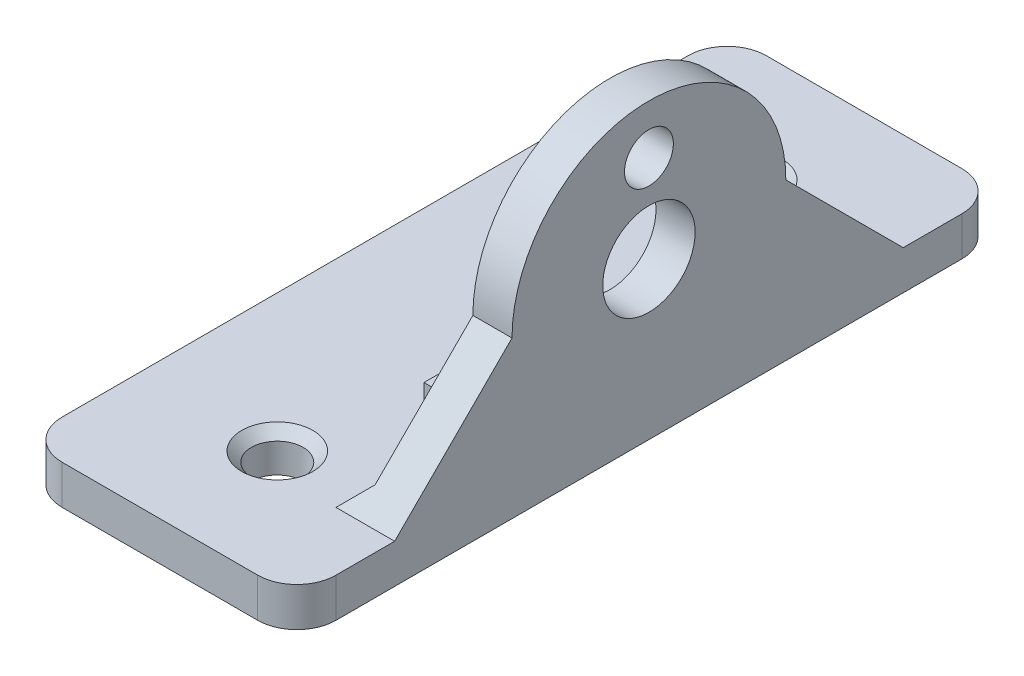
ISO-10303-21;
HEADER;
FILE_DESCRIPTION(('STEP AP214'),'2;1');
FILE_NAME('part.step','',(''),(''),'','','');
FILE_SCHEMA(('AUTOMOTIVE_DESIGN { 1 0 10303 214 1 1 1 1 }'));
ENDSEC;
DATA;
#1=APPLICATION_CONTEXT('core data for automotive mechanical design processes');
#2=APPLICATION_PROTOCOL_DEFINITION('international standard','automotive_design',2000,#1);
#3=PRODUCT_CONTEXT('',#1,'mechanical');
#4=PRODUCT('Part','Part','',(#3));
#5=PRODUCT_RELATED_PRODUCT_CATEGORY('part','',(#4));
#6=PRODUCT_DEFINITION_FORMATION('','',#4);
#7=PRODUCT_DEFINITION_CONTEXT('part definition',#1,'design');
#8=PRODUCT_DEFINITION('design','',#6,#7);
#9=PRODUCT_DEFINITION_SHAPE('','',#8);
#10=(LENGTH_UNIT() NAMED_UNIT(*) SI_UNIT(.MILLI.,.METRE.));
#11=(NAMED_UNIT(*) PLANE_ANGLE_UNIT() SI_UNIT($,.RADIAN.));
#12=(NAMED_UNIT(*) SI_UNIT($,.STERADIAN.) SOLID_ANGLE_UNIT());
#13=UNCERTAINTY_MEASURE_WITH_UNIT(LENGTH_MEASURE(1.E-05),#10,'distance_accuracy_value','');
#14=(GEOMETRIC_REPRESENTATION_CONTEXT(3) GLOBAL_UNCERTAINTY_ASSIGNED_CONTEXT((#13)) GLOBAL_UNIT_ASSIGNED_CONTEXT((#10,
#11,#12)) REPRESENTATION_CONTEXT('',''));
#15=CARTESIAN_POINT('',(0.,0.,0.));
#16=DIRECTION('',(0.,0.,1.));
#17=DIRECTION('',(1.,0.,0.));
#18=AXIS2_PLACEMENT_3D('',#15,#16,#17);
#19=CARTESIAN_POINT('',(-3.175,12.7,0.));
#20=DIRECTION('',(1.,0.,0.));
#21=DIRECTION('',(0.,0.,-1.));
#22=AXIS2_PLACEMENT_3D('',#19,#20,#21);
#23=PLANE('',#22);
#24=CARTESIAN_POINT('',(-3.175,19.812,0.));
#25=DIRECTION('',(1.,0.,0.));
#26=DIRECTION('',(0.,0.,-1.));
#27=AXIS2_PLACEMENT_3D('',#24,#25,#26);
#28=CIRCLE('',#27,1.984375);
#29=CARTESIAN_POINT('',(-3.175,19.812,-1.984375));
#30=VERTEX_POINT('',#29);
#31=EDGE_CURVE('E217',#30,#30,#28,.T.);
#32=ORIENTED_EDGE('',*,*,#31,.T.);
#33=EDGE_LOOP('',(#32));
#34=FACE_BOUND('',#33,.T.);
#35=CARTESIAN_POINT('',(-3.175,12.7,0.));
#36=DIRECTION('',(1.,0.,0.));
#37=DIRECTION('',(0.,0.,-1.));
#38=AXIS2_PLACEMENT_3D('',#35,#36,#37);
#39=CIRCLE('',#38,3.75);
#40=CARTESIAN_POINT('',(-3.175,12.7,-3.75));
#41=VERTEX_POINT('',#40);
#42=EDGE_CURVE('E223',#41,#41,#39,.T.);
#43=ORIENTED_EDGE('',*,*,#42,.T.);
#44=EDGE_LOOP('',(#43));
#45=FACE_BOUND('',#44,.T.);
#46=DIRECTION('',(0.,0.707106781186549,0.707106781186546));
#47=VECTOR('',#46,1.);
#48=CARTESIAN_POINT('',(-3.175,3.17500000000001,-20.6375));
#49=LINE('',#48,#47);
#50=CARTESIAN_POINT('',(-3.175,4.76250000000002,-19.05));
#51=VERTEX_POINT('',#50);
#52=CARTESIAN_POINT('',(-3.175,12.7,-11.1125));
#53=VERTEX_POINT('',#52);
#54=EDGE_CURVE('E229',#51,#53,#49,.T.);
#55=ORIENTED_EDGE('',*,*,#54,.F.);
#56=DIRECTION('',(0.,0.,1.));
#57=VECTOR('',#56,1.);
#58=CARTESIAN_POINT('',(-3.175,4.76250000000001,0.));
#59=LINE('',#58,#57);
#60=CARTESIAN_POINT('',(-3.175,4.76250000000001,7.9375));
#61=VERTEX_POINT('',#60);
#62=EDGE_CURVE('E292',#51,#61,#59,.T.);
#63=ORIENTED_EDGE('',*,*,#62,.T.);
#64=DIRECTION('',(0.,-1.,0.));
#65=VECTOR('',#64,1.);
#66=CARTESIAN_POINT('',(-3.175,5.20700000000001,7.9375));
#67=LINE('',#66,#65);
#68=CARTESIAN_POINT('',(-3.175,5.20700000000001,7.9375));
#69=VERTEX_POINT('',#68);
#70=EDGE_CURVE('E198',#69,#61,#67,.T.);
#71=ORIENTED_EDGE('',*,*,#70,.F.);
#72=DIRECTION('',(0.,0.,-1.));
#73=VECTOR('',#72,1.);
#74=CARTESIAN_POINT('',(-3.175,5.20700000000001,7.9375));
#75=LINE('',#74,#73);
#76=CARTESIAN_POINT('',(-3.175,5.20700000000001,10.31875));
#77=VERTEX_POINT('',#76);
#78=EDGE_CURVE('E204',#77,#69,#75,.T.);
#79=ORIENTED_EDGE('',*,*,#78,.F.);
#80=DIRECTION('',(0.,1.,0.));
#81=VECTOR('',#80,1.);
#82=CARTESIAN_POINT('',(-3.175,5.20700000000001,10.31875));
#83=LINE('',#82,#81);
#84=CARTESIAN_POINT('',(-3.175,4.76250000000001,10.31875));
#85=VERTEX_POINT('',#84);
#86=EDGE_CURVE('E201',#85,#77,#83,.T.);
#87=ORIENTED_EDGE('',*,*,#86,.F.);
#88=DIRECTION('',(0.,0.,1.));
#89=VECTOR('',#88,1.);
#90=CARTESIAN_POINT('',(-3.175,4.76250000000002,0.));
#91=LINE('',#90,#89);
#92=CARTESIAN_POINT('',(-3.175,4.76250000000001,19.0499999999999));
#93=VERTEX_POINT('',#92);
#94=EDGE_CURVE('E290',#85,#93,#91,.T.);
#95=ORIENTED_EDGE('',*,*,#94,.T.);
#96=DIRECTION('',(0.,-0.707106781186549,0.707106781186546));
#97=VECTOR('',#96,1.);
#98=CARTESIAN_POINT('',(-3.175,3.175,20.6374999999999));
#99=LINE('',#98,#97);
#100=CARTESIAN_POINT('',(-3.175,12.7,11.1125));
#101=VERTEX_POINT('',#100);
#102=EDGE_CURVE('E235',#101,#93,#99,.T.);
#103=ORIENTED_EDGE('',*,*,#102,.F.);
#104=CARTESIAN_POINT('',(-3.175,12.7,0.));
#105=DIRECTION('',(1.,0.,0.));
#106=DIRECTION('',(0.,0.,-1.));
#107=AXIS2_PLACEMENT_3D('',#104,#105,#106);
#108=CIRCLE('',#107,11.1125);
#109=EDGE_CURVE('E231',#53,#101,#108,.T.);
#110=ORIENTED_EDGE('',*,*,#109,.F.);
#111=EDGE_LOOP('',(#55,#63,#71,#79,#87,#95,#103,#110));
#112=FACE_BOUND('',#111,.T.);
#113=ADVANCED_FACE('F40',(#34,#45,#112),#23,.F.);
#114=CARTESIAN_POINT('',(-3.175,3.175,20.6374999999999));
#115=DIRECTION('',(0.,1.,0.));
#116=DIRECTION('',(0.,0.,1.));
#117=AXIS2_PLACEMENT_3D('',#114,#115,#116);
#118=PLANE('',#117);
#119=CARTESIAN_POINT('',(-11.1125,3.175,19.05));
#120=DIRECTION('',(0.,1.,0.));
#121=DIRECTION('',(0.,0.,1.));
#122=AXIS2_PLACEMENT_3D('',#119,#120,#121);
#123=CIRCLE('',#122,2.88925000000004);
#124=CARTESIAN_POINT('',(-11.1125,3.175,21.93925));
#125=VERTEX_POINT('',#124);
#126=EDGE_CURVE('E280',#125,#125,#123,.F.);
#127=ORIENTED_EDGE('',*,*,#126,.T.);
#128=EDGE_LOOP('',(#127));
#129=FACE_BOUND('',#128,.T.);
#130=CARTESIAN_POINT('',(-11.1125,3.17500000000001,-19.05));
#131=DIRECTION('',(0.,1.,0.));
#132=DIRECTION('',(0.,0.,1.));
#133=AXIS2_PLACEMENT_3D('',#130,#131,#132);
#134=CIRCLE('',#133,2.88925000000002);
#135=CARTESIAN_POINT('',(-11.1125,3.175,-16.16075));
#136=VERTEX_POINT('',#135);
#137=EDGE_CURVE('E277',#136,#136,#134,.F.);
#138=ORIENTED_EDGE('',*,*,#137,.T.);
#139=EDGE_LOOP('',(#138));
#140=FACE_BOUND('',#139,.T.);
#141=DIRECTION('',(0.,0.,1.));
#142=VECTOR('',#141,1.);
#143=CARTESIAN_POINT('',(0.,3.17500000000001,-28.575));
#144=LINE('',#143,#142);
#145=CARTESIAN_POINT('',(0.,3.17500000000001,-25.4));
#146=VERTEX_POINT('',#145);
#147=CARTESIAN_POINT('',(0.,3.17500000000001,-20.6375));
#148=VERTEX_POINT('',#147);
#149=EDGE_CURVE('E241',#146,#148,#144,.T.);
#150=ORIENTED_EDGE('',*,*,#149,.F.);
#151=CARTESIAN_POINT('',(-3.175,3.17500000000001,-25.4));
#152=DIRECTION('',(0.,1.,0.));
#153=DIRECTION('',(0.,0.,1.));
#154=AXIS2_PLACEMENT_3D('',#151,#152,#153);
#155=CIRCLE('',#154,3.175);
#156=CARTESIAN_POINT('',(-3.175,3.17500000000001,-28.575));
#157=VERTEX_POINT('',#156);
#158=EDGE_CURVE('E315',#146,#157,#155,.T.);
#159=ORIENTED_EDGE('',*,*,#158,.T.);
#160=DIRECTION('',(1.,0.,0.));
#161=VECTOR('',#160,1.);
#162=CARTESIAN_POINT('',(-3.175,3.17500000000001,-28.575));
#163=LINE('',#162,#161);
#164=CARTESIAN_POINT('',(-19.05,3.17500000000001,-28.575));
#165=VERTEX_POINT('',#164);
#166=EDGE_CURVE('E267',#165,#157,#163,.T.);
#167=ORIENTED_EDGE('',*,*,#166,.F.);
#168=CARTESIAN_POINT('',(-19.05,3.17500000000001,-25.4));
#169=DIRECTION('',(0.,1.,0.));
#170=DIRECTION('',(0.,0.,1.));
#171=AXIS2_PLACEMENT_3D('',#168,#169,#170);
#172=CIRCLE('',#171,3.175);
#173=CARTESIAN_POINT('',(-22.225,3.17500000000001,-25.4));
#174=VERTEX_POINT('',#173);
#175=EDGE_CURVE('E313',#165,#174,#172,.T.);
#176=ORIENTED_EDGE('',*,*,#175,.T.);
#177=DIRECTION('',(0.,0.,-1.));
#178=VECTOR('',#177,1.);
#179=CARTESIAN_POINT('',(-22.225,3.17500000000001,-28.575));
#180=LINE('',#179,#178);
#181=CARTESIAN_POINT('',(-22.225,3.17500000000001,25.4));
#182=VERTEX_POINT('',#181);
#183=EDGE_CURVE('E213',#182,#174,#180,.T.);
#184=ORIENTED_EDGE('',*,*,#183,.F.);
#185=CARTESIAN_POINT('',(-19.05,3.175,25.4));
#186=DIRECTION('',(0.,1.,0.));
#187=DIRECTION('',(0.,0.,1.));
#188=AXIS2_PLACEMENT_3D('',#185,#186,#187);
#189=CIRCLE('',#188,3.175);
#190=CARTESIAN_POINT('',(-19.05,3.175,28.575));
#191=VERTEX_POINT('',#190);
#192=EDGE_CURVE('E311',#182,#191,#189,.T.);
#193=ORIENTED_EDGE('',*,*,#192,.T.);
#194=DIRECTION('',(1.,0.,0.));
#195=VECTOR('',#194,1.);
#196=CARTESIAN_POINT('',(-3.175,3.175,28.575));
#197=LINE('',#196,#195);
#198=CARTESIAN_POINT('',(-3.175,3.175,28.575));
#199=VERTEX_POINT('',#198);
#200=EDGE_CURVE('E254',#191,#199,#197,.T.);
#201=ORIENTED_EDGE('',*,*,#200,.T.);
#202=CARTESIAN_POINT('',(-3.175,3.175,25.4));
#203=DIRECTION('',(0.,1.,0.));
#204=DIRECTION('',(0.,0.,1.));
#205=AXIS2_PLACEMENT_3D('',#202,#203,#204);
#206=CIRCLE('',#205,3.175);
#207=CARTESIAN_POINT('',(0.,3.175,25.4));
#208=VERTEX_POINT('',#207);
#209=EDGE_CURVE('E309',#199,#208,#206,.T.);
#210=ORIENTED_EDGE('',*,*,#209,.T.);
#211=DIRECTION('',(0.,0.,1.));
#212=VECTOR('',#211,1.);
#213=CARTESIAN_POINT('',(0.,3.175,20.6374999999999));
#214=LINE('',#213,#212);
#215=CARTESIAN_POINT('',(0.,3.175,20.6374999999999));
#216=VERTEX_POINT('',#215);
#217=EDGE_CURVE('E232',#216,#208,#214,.T.);
#218=ORIENTED_EDGE('',*,*,#217,.F.);
#219=DIRECTION('',(1.,0.,0.));
#220=VECTOR('',#219,1.);
#221=CARTESIAN_POINT('',(-3.175,3.175,20.6374999999999));
#222=LINE('',#221,#220);
#223=CARTESIAN_POINT('',(-4.76250000000003,3.175,20.6374999999999));
#224=VERTEX_POINT('',#223);
#225=EDGE_CURVE('E258',#224,#216,#222,.T.);
#226=ORIENTED_EDGE('',*,*,#225,.F.);
#227=DIRECTION('',(0.,0.,-1.));
#228=VECTOR('',#227,1.);
#229=CARTESIAN_POINT('',(-4.76250000000003,3.175,20.6374999999999));
#230=LINE('',#229,#228);
#231=CARTESIAN_POINT('',(-4.76250000000003,3.17500000000001,10.31875));
#232=VERTEX_POINT('',#231);
#233=EDGE_CURVE('E175',#224,#232,#230,.T.);
#234=ORIENTED_EDGE('',*,*,#233,.T.);
#235=DIRECTION('',(1.,0.,0.));
#236=VECTOR('',#235,1.);
#237=CARTESIAN_POINT('',(-7.9375,3.17500000000001,10.31875));
#238=LINE('',#237,#236);
#239=CARTESIAN_POINT('',(-7.9375,3.17500000000001,10.31875));
#240=VERTEX_POINT('',#239);
#241=EDGE_CURVE('E167',#240,#232,#238,.T.);
#242=ORIENTED_EDGE('',*,*,#241,.F.);
#243=DIRECTION('',(0.,0.,1.));
#244=VECTOR('',#243,1.);
#245=CARTESIAN_POINT('',(-7.9375,3.17500000000001,7.9375));
#246=LINE('',#245,#244);
#247=CARTESIAN_POINT('',(-7.9375,3.175,7.9375));
#248=VERTEX_POINT('',#247);
#249=EDGE_CURVE('E172',#248,#240,#246,.T.);
#250=ORIENTED_EDGE('',*,*,#249,.F.);
#251=DIRECTION('',(1.,0.,0.));
#252=VECTOR('',#251,1.);
#253=CARTESIAN_POINT('',(-7.9375,3.17500000000001,7.9375));
#254=LINE('',#253,#252);
#255=CARTESIAN_POINT('',(-4.76250000000003,3.17500000000001,7.9375));
#256=VERTEX_POINT('',#255);
#257=EDGE_CURVE('E178',#248,#256,#254,.T.);
#258=ORIENTED_EDGE('',*,*,#257,.T.);
#259=DIRECTION('',(0.,0.,-1.));
#260=VECTOR('',#259,1.);
#261=CARTESIAN_POINT('',(-4.76250000000003,3.175,20.6374999999999));
#262=LINE('',#261,#260);
#263=CARTESIAN_POINT('',(-4.76250000000003,3.17500000000001,-20.6375));
#264=VERTEX_POINT('',#263);
#265=EDGE_CURVE('E287',#256,#264,#262,.T.);
#266=ORIENTED_EDGE('',*,*,#265,.T.);
#267=DIRECTION('',(1.,0.,0.));
#268=VECTOR('',#267,1.);
#269=CARTESIAN_POINT('',(-3.175,3.17500000000001,-20.6375));
#270=LINE('',#269,#268);
#271=EDGE_CURVE('E264',#264,#148,#270,.T.);
#272=ORIENTED_EDGE('',*,*,#271,.T.);
#273=EDGE_LOOP('',(#150,#159,#167,#176,#184,#193,#201,#210,#218,#226,#234,#242,#250,#258,#266,#272));
#274=FACE_BOUND('',#273,.T.);
#275=ADVANCED_FACE('F170',(#129,#140,#274),#118,.T.);
#276=CARTESIAN_POINT('',(-3.175,3.175,28.575));
#277=DIRECTION('',(0.,0.,1.));
#278=DIRECTION('',(1.,0.,0.));
#279=AXIS2_PLACEMENT_3D('',#276,#277,#278);
#280=PLANE('',#279);
#281=ORIENTED_EDGE('',*,*,#200,.F.);
#282=DIRECTION('',(0.,1.,0.));
#283=VECTOR('',#282,1.);
#284=CARTESIAN_POINT('',(-19.05,3.175,28.575));
#285=LINE('',#284,#283);
#286=CARTESIAN_POINT('',(-19.05,0.,28.575));
#287=VERTEX_POINT('',#286);
#288=EDGE_CURVE('E11',#191,#287,#285,.F.);
#289=ORIENTED_EDGE('',*,*,#288,.T.);
#290=DIRECTION('',(1.,0.,0.));
#291=VECTOR('',#290,1.);
#292=CARTESIAN_POINT('',(-3.175,0.,28.575));
#293=LINE('',#292,#291);
#294=CARTESIAN_POINT('',(-3.175,0.,28.575));
#295=VERTEX_POINT('',#294);
#296=EDGE_CURVE('E238',#287,#295,#293,.T.);
#297=ORIENTED_EDGE('',*,*,#296,.T.);
#298=DIRECTION('',(0.,-1.,0.));
#299=VECTOR('',#298,1.);
#300=CARTESIAN_POINT('',(-3.175,3.175,28.575));
#301=LINE('',#300,#299);
#302=EDGE_CURVE('E48',#295,#199,#301,.F.);
#303=ORIENTED_EDGE('',*,*,#302,.T.);
#304=EDGE_LOOP('',(#281,#289,#297,#303));
#305=FACE_BOUND('',#304,.T.);
#306=ADVANCED_FACE('F334',(#305),#280,.T.);
#307=CARTESIAN_POINT('',(-3.175,3.175,20.6374999999999));
#308=DIRECTION('',(0.,0.707106781186546,0.707106781186549));
#309=DIRECTION('',(0.,-0.707106781186549,0.707106781186546));
#310=AXIS2_PLACEMENT_3D('',#307,#308,#309);
#311=PLANE('',#310);
#312=DIRECTION('',(0.,-0.707106781186549,0.707106781186546));
#313=VECTOR('',#312,1.);
#314=CARTESIAN_POINT('',(0.,3.175,20.6374999999999));
#315=LINE('',#314,#313);
#316=CARTESIAN_POINT('',(0.,12.7,11.1125));
#317=VERTEX_POINT('',#316);
#318=EDGE_CURVE('E249',#317,#216,#315,.T.);
#319=ORIENTED_EDGE('',*,*,#318,.F.);
#320=DIRECTION('',(1.,0.,0.));
#321=VECTOR('',#320,1.);
#322=CARTESIAN_POINT('',(-3.175,12.7,11.1125));
#323=LINE('',#322,#321);
#324=EDGE_CURVE('E260',#101,#317,#323,.T.);
#325=ORIENTED_EDGE('',*,*,#324,.F.);
#326=ORIENTED_EDGE('',*,*,#102,.T.);
#327=DIRECTION('',(-0.577350269189632,-0.577350269189624,0.577350269189622));
#328=VECTOR('',#327,1.);
#329=CARTESIAN_POINT('',(-4.76250000000003,3.175,20.6374999999999));
#330=LINE('',#329,#328);
#331=EDGE_CURVE('E300',#93,#224,#330,.T.);
#332=ORIENTED_EDGE('',*,*,#331,.T.);
#333=ORIENTED_EDGE('',*,*,#225,.T.);
#334=EDGE_LOOP('',(#319,#325,#326,#332,#333));
#335=FACE_BOUND('',#334,.T.);
#336=ADVANCED_FACE('F365',(#335),#311,.T.);
#337=CARTESIAN_POINT('',(-3.175,12.7,0.));
#338=DIRECTION('',(1.,0.,0.));
#339=DIRECTION('',(0.,0.,-1.));
#340=AXIS2_PLACEMENT_3D('',#337,#338,#339);
#341=CYLINDRICAL_SURFACE('',#340,11.1125);
#342=CARTESIAN_POINT('',(0.,12.7,0.));
#343=DIRECTION('',(1.,0.,0.));
#344=DIRECTION('',(0.,0.,-1.));
#345=AXIS2_PLACEMENT_3D('',#342,#343,#344);
#346=CIRCLE('',#345,11.1125);
#347=CARTESIAN_POINT('',(0.,12.7,-11.1125));
#348=VERTEX_POINT('',#347);
#349=EDGE_CURVE('E246',#348,#317,#346,.T.);
#350=ORIENTED_EDGE('',*,*,#349,.F.);
#351=DIRECTION('',(1.,0.,0.));
#352=VECTOR('',#351,1.);
#353=CARTESIAN_POINT('',(-3.175,12.7,-11.1125));
#354=LINE('',#353,#352);
#355=EDGE_CURVE('E262',#53,#348,#354,.T.);
#356=ORIENTED_EDGE('',*,*,#355,.F.);
#357=ORIENTED_EDGE('',*,*,#109,.T.);
#358=ORIENTED_EDGE('',*,*,#324,.T.);
#359=EDGE_LOOP('',(#350,#356,#357,#358));
#360=FACE_BOUND('',#359,.T.);
#361=ADVANCED_FACE('F361',(#360),#341,.T.);
#362=CARTESIAN_POINT('',(-3.175,3.17500000000001,-20.6375));
#363=DIRECTION('',(0.,0.707106781186546,-0.707106781186549));
#364=DIRECTION('',(0.,0.707106781186549,0.707106781186546));
#365=AXIS2_PLACEMENT_3D('',#362,#363,#364);
#366=PLANE('',#365);
#367=DIRECTION('',(0.,0.707106781186549,0.707106781186546));
#368=VECTOR('',#367,1.);
#369=CARTESIAN_POINT('',(0.,3.17500000000001,-20.6375));
#370=LINE('',#369,#368);
#371=EDGE_CURVE('E243',#148,#348,#370,.T.);
#372=ORIENTED_EDGE('',*,*,#371,.F.);
#373=ORIENTED_EDGE('',*,*,#271,.F.);
#374=DIRECTION('',(0.577350269189632,0.577350269189624,0.577350269189622));
#375=VECTOR('',#374,1.);
#376=CARTESIAN_POINT('',(8.99583333333331,16.9333333333332,-6.87916666666685));
#377=LINE('',#376,#375);
#378=EDGE_CURVE('E298',#264,#51,#377,.T.);
#379=ORIENTED_EDGE('',*,*,#378,.T.);
#380=ORIENTED_EDGE('',*,*,#54,.T.);
#381=ORIENTED_EDGE('',*,*,#355,.T.);
#382=EDGE_LOOP('',(#372,#373,#379,#380,#381));
#383=FACE_BOUND('',#382,.T.);
#384=ADVANCED_FACE('F356',(#383),#366,.T.);
#385=CARTESIAN_POINT('',(-3.175,0.,-28.575));
#386=DIRECTION('',(0.,0.,-1.));
#387=DIRECTION('',(-1.,0.,0.));
#388=AXIS2_PLACEMENT_3D('',#385,#386,#387);
#389=PLANE('',#388);
#390=ORIENTED_EDGE('',*,*,#166,.T.);
#391=DIRECTION('',(0.,1.,0.));
#392=VECTOR('',#391,1.);
#393=CARTESIAN_POINT('',(-3.175,0.,-28.575));
#394=LINE('',#393,#392);
#395=CARTESIAN_POINT('',(-3.175,0.,-28.575));
#396=VERTEX_POINT('',#395);
#397=EDGE_CURVE('E319',#157,#396,#394,.F.);
#398=ORIENTED_EDGE('',*,*,#397,.T.);
#399=DIRECTION('',(1.,0.,0.));
#400=VECTOR('',#399,1.);
#401=CARTESIAN_POINT('',(-3.175,0.,-28.575));
#402=LINE('',#401,#400);
#403=CARTESIAN_POINT('',(-19.05,0.,-28.575));
#404=VERTEX_POINT('',#403);
#405=EDGE_CURVE('E270',#404,#396,#402,.T.);
#406=ORIENTED_EDGE('',*,*,#405,.F.);
#407=DIRECTION('',(0.,-1.,0.));
#408=VECTOR('',#407,1.);
#409=CARTESIAN_POINT('',(-19.05,0.,-28.575));
#410=LINE('',#409,#408);
#411=EDGE_CURVE('E317',#404,#165,#410,.F.);
#412=ORIENTED_EDGE('',*,*,#411,.T.);
#413=EDGE_LOOP('',(#390,#398,#406,#412));
#414=FACE_BOUND('',#413,.T.);
#415=ADVANCED_FACE('F425',(#414),#389,.T.);
#416=CARTESIAN_POINT('',(-3.175,0.,28.575));
#417=DIRECTION('',(0.,-1.,0.));
#418=DIRECTION('',(0.,0.,-1.));
#419=AXIS2_PLACEMENT_3D('',#416,#417,#418);
#420=PLANE('',#419);
#421=CARTESIAN_POINT('',(-11.1125,0.,19.05));
#422=DIRECTION('',(0.,1.,0.));
#423=DIRECTION('',(0.,0.,1.));
#424=AXIS2_PLACEMENT_3D('',#421,#422,#423);
#425=CIRCLE('',#424,2.0955);
#426=CARTESIAN_POINT('',(-11.1125,0.,21.1455));
#427=VERTEX_POINT('',#426);
#428=EDGE_CURVE('E202',#427,#427,#425,.T.);
#429=ORIENTED_EDGE('',*,*,#428,.T.);
#430=EDGE_LOOP('',(#429));
#431=FACE_BOUND('',#430,.T.);
#432=CARTESIAN_POINT('',(-11.1125,0.,-19.05));
#433=DIRECTION('',(0.,1.,0.));
#434=DIRECTION('',(0.,0.,-1.));
#435=AXIS2_PLACEMENT_3D('',#432,#433,#434);
#436=CIRCLE('',#435,2.0955);
#437=CARTESIAN_POINT('',(-11.1125,0.,-21.1455));
#438=VERTEX_POINT('',#437);
#439=EDGE_CURVE('E380',#438,#438,#436,.T.);
#440=ORIENTED_EDGE('',*,*,#439,.T.);
#441=EDGE_LOOP('',(#440));
#442=FACE_BOUND('',#441,.T.);
#443=ORIENTED_EDGE('',*,*,#405,.T.);
#444=CARTESIAN_POINT('',(-3.175,0.,-25.4));
#445=DIRECTION('',(0.,-1.,0.));
#446=DIRECTION('',(0.,0.,-1.));
#447=AXIS2_PLACEMENT_3D('',#444,#445,#446);
#448=CIRCLE('',#447,3.175);
#449=CARTESIAN_POINT('',(0.,0.,-25.4));
#450=VERTEX_POINT('',#449);
#451=EDGE_CURVE('E325',#396,#450,#448,.T.);
#452=ORIENTED_EDGE('',*,*,#451,.T.);
#453=DIRECTION('',(0.,0.,-1.));
#454=VECTOR('',#453,1.);
#455=CARTESIAN_POINT('',(0.,0.,28.575));
#456=LINE('',#455,#454);
#457=CARTESIAN_POINT('',(0.,0.,25.4));
#458=VERTEX_POINT('',#457);
#459=EDGE_CURVE('E226',#458,#450,#456,.T.);
#460=ORIENTED_EDGE('',*,*,#459,.F.);
#461=CARTESIAN_POINT('',(-3.175,0.,25.4));
#462=DIRECTION('',(0.,-1.,0.));
#463=DIRECTION('',(0.,0.,-1.));
#464=AXIS2_PLACEMENT_3D('',#461,#462,#463);
#465=CIRCLE('',#464,3.175);
#466=EDGE_CURVE('E321',#458,#295,#465,.T.);
#467=ORIENTED_EDGE('',*,*,#466,.T.);
#468=ORIENTED_EDGE('',*,*,#296,.F.);
#469=CARTESIAN_POINT('',(-19.05,0.,25.4));
#470=DIRECTION('',(0.,-1.,0.));
#471=DIRECTION('',(0.,0.,-1.));
#472=AXIS2_PLACEMENT_3D('',#469,#470,#471);
#473=CIRCLE('',#472,3.175);
#474=CARTESIAN_POINT('',(-22.225,0.,25.4));
#475=VERTEX_POINT('',#474);
#476=EDGE_CURVE('E55',#287,#475,#473,.T.);
#477=ORIENTED_EDGE('',*,*,#476,.T.);
#478=DIRECTION('',(0.,0.,1.));
#479=VECTOR('',#478,1.);
#480=CARTESIAN_POINT('',(-22.225,0.,-28.575));
#481=LINE('',#480,#479);
#482=CARTESIAN_POINT('',(-22.225,0.,-25.4));
#483=VERTEX_POINT('',#482);
#484=EDGE_CURVE('E211',#483,#475,#481,.T.);
#485=ORIENTED_EDGE('',*,*,#484,.F.);
#486=CARTESIAN_POINT('',(-19.05,0.,-25.4));
#487=DIRECTION('',(0.,-1.,0.));
#488=DIRECTION('',(0.,0.,-1.));
#489=AXIS2_PLACEMENT_3D('',#486,#487,#488);
#490=CIRCLE('',#489,3.175);
#491=EDGE_CURVE('E63',#483,#404,#490,.T.);
#492=ORIENTED_EDGE('',*,*,#491,.T.);
#493=EDGE_LOOP('',(#443,#452,#460,#467,#468,#477,#485,#492));
#494=FACE_BOUND('',#493,.T.);
#495=ADVANCED_FACE('F345',(#431,#442,#494),#420,.T.);
#496=CARTESIAN_POINT('',(0.,12.7,0.));
#497=DIRECTION('',(1.,0.,0.));
#498=DIRECTION('',(0.,0.,-1.));
#499=AXIS2_PLACEMENT_3D('',#496,#497,#498);
#500=PLANE('',#499);
#501=CARTESIAN_POINT('',(0.,19.812,0.));
#502=DIRECTION('',(1.,0.,0.));
#503=DIRECTION('',(0.,0.,-1.));
#504=AXIS2_PLACEMENT_3D('',#501,#502,#503);
#505=CIRCLE('',#504,1.984375);
#506=CARTESIAN_POINT('',(0.,19.812,-1.984375));
#507=VERTEX_POINT('',#506);
#508=EDGE_CURVE('E216',#507,#507,#505,.T.);
#509=ORIENTED_EDGE('',*,*,#508,.F.);
#510=EDGE_LOOP('',(#509));
#511=FACE_BOUND('',#510,.T.);
#512=CARTESIAN_POINT('',(0.,12.7,0.));
#513=DIRECTION('',(1.,0.,0.));
#514=DIRECTION('',(0.,0.,-1.));
#515=AXIS2_PLACEMENT_3D('',#512,#513,#514);
#516=CIRCLE('',#515,3.75);
#517=CARTESIAN_POINT('',(0.,12.7,-3.75));
#518=VERTEX_POINT('',#517);
#519=EDGE_CURVE('E220',#518,#518,#516,.T.);
#520=ORIENTED_EDGE('',*,*,#519,.F.);
#521=EDGE_LOOP('',(#520));
#522=FACE_BOUND('',#521,.T.);
#523=ORIENTED_EDGE('',*,*,#459,.T.);
#524=DIRECTION('',(0.,1.,0.));
#525=VECTOR('',#524,1.);
#526=CARTESIAN_POINT('',(0.,12.7,-25.4));
#527=LINE('',#526,#525);
#528=EDGE_CURVE('E306',#450,#146,#527,.T.);
#529=ORIENTED_EDGE('',*,*,#528,.T.);
#530=ORIENTED_EDGE('',*,*,#149,.T.);
#531=ORIENTED_EDGE('',*,*,#371,.T.);
#532=ORIENTED_EDGE('',*,*,#349,.T.);
#533=ORIENTED_EDGE('',*,*,#318,.T.);
#534=ORIENTED_EDGE('',*,*,#217,.T.);
#535=DIRECTION('',(0.,-1.,0.));
#536=VECTOR('',#535,1.);
#537=CARTESIAN_POINT('',(0.,12.7,25.4));
#538=LINE('',#537,#536);
#539=EDGE_CURVE('E303',#208,#458,#538,.T.);
#540=ORIENTED_EDGE('',*,*,#539,.T.);
#541=EDGE_LOOP('',(#523,#529,#530,#531,#532,#533,#534,#540));
#542=FACE_BOUND('',#541,.T.);
#543=ADVANCED_FACE('F343',(#511,#522,#542),#500,.T.);
#544=CARTESIAN_POINT('',(-3.175,12.7,0.));
#545=DIRECTION('',(1.,0.,0.));
#546=DIRECTION('',(0.,0.,-1.));
#547=AXIS2_PLACEMENT_3D('',#544,#545,#546);
#548=CYLINDRICAL_SURFACE('',#547,3.75);
#549=ORIENTED_EDGE('',*,*,#42,.F.);
#550=EDGE_LOOP('',(#549));
#551=FACE_BOUND('',#550,.T.);
#552=ORIENTED_EDGE('',*,*,#519,.T.);
#553=EDGE_LOOP('',(#552));
#554=FACE_BOUND('',#553,.T.);
#555=ADVANCED_FACE('F414',(#551,#554),#548,.F.);
#556=CARTESIAN_POINT('',(-3.175,19.812,0.));
#557=DIRECTION('',(1.,0.,0.));
#558=DIRECTION('',(0.,0.,-1.));
#559=AXIS2_PLACEMENT_3D('',#556,#557,#558);
#560=CYLINDRICAL_SURFACE('',#559,1.984375);
#561=ORIENTED_EDGE('',*,*,#31,.F.);
#562=EDGE_LOOP('',(#561));
#563=FACE_BOUND('',#562,.T.);
#564=ORIENTED_EDGE('',*,*,#508,.T.);
#565=EDGE_LOOP('',(#564));
#566=FACE_BOUND('',#565,.T.);
#567=ADVANCED_FACE('F469',(#563,#566),#560,.F.);
#568=CARTESIAN_POINT('',(-22.225,0.,0.));
#569=DIRECTION('',(-1.,0.,0.));
#570=DIRECTION('',(0.,0.,1.));
#571=AXIS2_PLACEMENT_3D('',#568,#569,#570);
#572=PLANE('',#571);
#573=ORIENTED_EDGE('',*,*,#183,.T.);
#574=DIRECTION('',(0.,-1.,0.));
#575=VECTOR('',#574,1.);
#576=CARTESIAN_POINT('',(-22.225,0.,-25.4));
#577=LINE('',#576,#575);
#578=EDGE_CURVE('E330',#174,#483,#577,.T.);
#579=ORIENTED_EDGE('',*,*,#578,.T.);
#580=ORIENTED_EDGE('',*,*,#484,.T.);
#581=DIRECTION('',(0.,1.,0.));
#582=VECTOR('',#581,1.);
#583=CARTESIAN_POINT('',(-22.225,0.,25.4));
#584=LINE('',#583,#582);
#585=EDGE_CURVE('E327',#475,#182,#584,.T.);
#586=ORIENTED_EDGE('',*,*,#585,.T.);
#587=EDGE_LOOP('',(#573,#579,#580,#586));
#588=FACE_BOUND('',#587,.T.);
#589=ADVANCED_FACE('F466',(#588),#572,.T.);
#590=CARTESIAN_POINT('',(-7.9375,5.20700000000001,7.9375));
#591=DIRECTION('',(0.,0.,1.));
#592=DIRECTION('',(1.,0.,0.));
#593=AXIS2_PLACEMENT_3D('',#590,#591,#592);
#594=PLANE('',#593);
#595=ORIENTED_EDGE('',*,*,#70,.T.);
#596=DIRECTION('',(-0.707106781186552,-0.707106781186543,0.));
#597=VECTOR('',#596,1.);
#598=CARTESIAN_POINT('',(-4.76250000000003,3.175,7.9375));
#599=LINE('',#598,#597);
#600=EDGE_CURVE('E294',#61,#256,#599,.T.);
#601=ORIENTED_EDGE('',*,*,#600,.T.);
#602=ORIENTED_EDGE('',*,*,#257,.F.);
#603=DIRECTION('',(0.,-1.,0.));
#604=VECTOR('',#603,1.);
#605=CARTESIAN_POINT('',(-7.9375,5.20700000000001,7.9375));
#606=LINE('',#605,#604);
#607=CARTESIAN_POINT('',(-7.9375,5.20700000000001,7.9375));
#608=VERTEX_POINT('',#607);
#609=EDGE_CURVE('E186',#608,#248,#606,.T.);
#610=ORIENTED_EDGE('',*,*,#609,.F.);
#611=DIRECTION('',(1.,0.,0.));
#612=VECTOR('',#611,1.);
#613=CARTESIAN_POINT('',(-7.9375,5.20700000000001,7.9375));
#614=LINE('',#613,#612);
#615=EDGE_CURVE('E194',#608,#69,#614,.T.);
#616=ORIENTED_EDGE('',*,*,#615,.T.);
#617=EDGE_LOOP('',(#595,#601,#602,#610,#616));
#618=FACE_BOUND('',#617,.T.);
#619=ADVANCED_FACE('F378',(#618),#594,.F.);
#620=CARTESIAN_POINT('',(-7.9375,5.20700000000001,10.31875));
#621=DIRECTION('',(0.,0.,-1.));
#622=DIRECTION('',(0.,1.,0.));
#623=AXIS2_PLACEMENT_3D('',#620,#621,#622);
#624=PLANE('',#623);
#625=ORIENTED_EDGE('',*,*,#241,.T.);
#626=DIRECTION('',(0.707106781186552,0.707106781186543,0.));
#627=VECTOR('',#626,1.);
#628=CARTESIAN_POINT('',(-4.76250000000003,3.17500000000001,10.31875));
#629=LINE('',#628,#627);
#630=EDGE_CURVE('E296',#232,#85,#629,.T.);
#631=ORIENTED_EDGE('',*,*,#630,.T.);
#632=ORIENTED_EDGE('',*,*,#86,.T.);
#633=DIRECTION('',(1.,0.,0.));
#634=VECTOR('',#633,1.);
#635=CARTESIAN_POINT('',(-7.9375,5.20700000000001,10.31875));
#636=LINE('',#635,#634);
#637=CARTESIAN_POINT('',(-7.9375,5.20700000000001,10.31875));
#638=VERTEX_POINT('',#637);
#639=EDGE_CURVE('E179',#638,#77,#636,.T.);
#640=ORIENTED_EDGE('',*,*,#639,.F.);
#641=DIRECTION('',(0.,1.,0.));
#642=VECTOR('',#641,1.);
#643=CARTESIAN_POINT('',(-7.9375,5.20700000000001,10.31875));
#644=LINE('',#643,#642);
#645=EDGE_CURVE('E183',#240,#638,#644,.T.);
#646=ORIENTED_EDGE('',*,*,#645,.F.);
#647=EDGE_LOOP('',(#625,#631,#632,#640,#646));
#648=FACE_BOUND('',#647,.T.);
#649=ADVANCED_FACE('F189',(#648),#624,.F.);
#650=CARTESIAN_POINT('',(-7.9375,5.20700000000001,7.9375));
#651=DIRECTION('',(0.,-1.,0.));
#652=DIRECTION('',(0.,0.,-1.));
#653=AXIS2_PLACEMENT_3D('',#650,#651,#652);
#654=PLANE('',#653);
#655=ORIENTED_EDGE('',*,*,#78,.T.);
#656=ORIENTED_EDGE('',*,*,#615,.F.);
#657=DIRECTION('',(0.,0.,-1.));
#658=VECTOR('',#657,1.);
#659=CARTESIAN_POINT('',(-7.9375,5.20700000000001,7.9375));
#660=LINE('',#659,#658);
#661=EDGE_CURVE('E192',#638,#608,#660,.T.);
#662=ORIENTED_EDGE('',*,*,#661,.F.);
#663=ORIENTED_EDGE('',*,*,#639,.T.);
#664=EDGE_LOOP('',(#655,#656,#662,#663));
#665=FACE_BOUND('',#664,.T.);
#666=ADVANCED_FACE('F376',(#665),#654,.F.);
#667=CARTESIAN_POINT('',(-7.9375,0.,0.));
#668=DIRECTION('',(-1.,0.,0.));
#669=DIRECTION('',(0.,0.,1.));
#670=AXIS2_PLACEMENT_3D('',#667,#668,#669);
#671=PLANE('',#670);
#672=ORIENTED_EDGE('',*,*,#609,.T.);
#673=ORIENTED_EDGE('',*,*,#249,.T.);
#674=ORIENTED_EDGE('',*,*,#645,.T.);
#675=ORIENTED_EDGE('',*,*,#661,.T.);
#676=EDGE_LOOP('',(#672,#673,#674,#675));
#677=FACE_BOUND('',#676,.T.);
#678=ADVANCED_FACE('F182',(#677),#671,.T.);
#679=CARTESIAN_POINT('',(-11.1125,0.,-19.05));
#680=DIRECTION('',(0.,1.,0.));
#681=DIRECTION('',(0.,0.,1.));
#682=AXIS2_PLACEMENT_3D('',#679,#680,#681);
#683=CYLINDRICAL_SURFACE('',#682,2.0955);
#684=CARTESIAN_POINT('',(-11.1125,2.38124999999999,-19.05));
#685=DIRECTION('',(0.,1.,0.));
#686=DIRECTION('',(0.,0.,1.));
#687=AXIS2_PLACEMENT_3D('',#684,#685,#686);
#688=CIRCLE('',#687,2.0955);
#689=CARTESIAN_POINT('',(-11.1125,2.38124999999999,-16.9545));
#690=VERTEX_POINT('',#689);
#691=EDGE_CURVE('E283',#690,#690,#688,.T.);
#692=ORIENTED_EDGE('',*,*,#691,.T.);
#693=EDGE_LOOP('',(#692));
#694=FACE_BOUND('',#693,.T.);
#695=ORIENTED_EDGE('',*,*,#439,.F.);
#696=EDGE_LOOP('',(#695));
#697=FACE_BOUND('',#696,.T.);
#698=ADVANCED_FACE('F391',(#694,#697),#683,.F.);
#699=CARTESIAN_POINT('',(-11.1125,0.,19.05));
#700=DIRECTION('',(0.,1.,0.));
#701=DIRECTION('',(0.,0.,1.));
#702=AXIS2_PLACEMENT_3D('',#699,#700,#701);
#703=CYLINDRICAL_SURFACE('',#702,2.0955);
#704=CARTESIAN_POINT('',(-11.1125,2.38124999999996,19.05));
#705=DIRECTION('',(0.,1.,0.));
#706=DIRECTION('',(0.,0.,1.));
#707=AXIS2_PLACEMENT_3D('',#704,#705,#706);
#708=CIRCLE('',#707,2.0955);
#709=CARTESIAN_POINT('',(-11.1125,2.38124999999996,21.1455));
#710=VERTEX_POINT('',#709);
#711=EDGE_CURVE('E257',#710,#710,#708,.T.);
#712=ORIENTED_EDGE('',*,*,#711,.T.);
#713=EDGE_LOOP('',(#712));
#714=FACE_BOUND('',#713,.T.);
#715=ORIENTED_EDGE('',*,*,#428,.F.);
#716=EDGE_LOOP('',(#715));
#717=FACE_BOUND('',#716,.T.);
#718=ADVANCED_FACE('F388',(#714,#717),#703,.F.);
#719=CARTESIAN_POINT('',(-11.1125,2.38124999999996,19.05));
#720=DIRECTION('',(0.,1.,0.));
#721=DIRECTION('',(0.,0.,1.));
#722=AXIS2_PLACEMENT_3D('',#719,#720,#721);
#723=CONICAL_SURFACE('',#722,2.0955,0.785398163397449);
#724=ORIENTED_EDGE('',*,*,#126,.F.);
#725=EDGE_LOOP('',(#724));
#726=FACE_BOUND('',#725,.T.);
#727=ORIENTED_EDGE('',*,*,#711,.F.);
#728=EDGE_LOOP('',(#727));
#729=FACE_BOUND('',#728,.T.);
#730=ADVANCED_FACE('F390',(#726,#729),#723,.F.);
#731=CARTESIAN_POINT('',(-11.1125,2.38124999999999,-19.05));
#732=DIRECTION('',(0.,1.,0.));
#733=DIRECTION('',(0.,0.,1.));
#734=AXIS2_PLACEMENT_3D('',#731,#732,#733);
#735=CONICAL_SURFACE('',#734,2.0955,0.785398163397448);
#736=ORIENTED_EDGE('',*,*,#137,.F.);
#737=EDGE_LOOP('',(#736));
#738=FACE_BOUND('',#737,.T.);
#739=ORIENTED_EDGE('',*,*,#691,.F.);
#740=EDGE_LOOP('',(#739));
#741=FACE_BOUND('',#740,.T.);
#742=ADVANCED_FACE('F398',(#738,#741),#735,.F.);
#743=CARTESIAN_POINT('',(-4.76250000000003,3.175,20.6374999999999));
#744=DIRECTION('',(0.707106781186543,-0.707106781186552,0.));
#745=DIRECTION('',(0.,0.,-1.));
#746=AXIS2_PLACEMENT_3D('',#743,#744,#745);
#747=PLANE('',#746);
#748=ORIENTED_EDGE('',*,*,#600,.F.);
#749=ORIENTED_EDGE('',*,*,#62,.F.);
#750=ORIENTED_EDGE('',*,*,#378,.F.);
#751=ORIENTED_EDGE('',*,*,#265,.F.);
#752=EDGE_LOOP('',(#748,#749,#750,#751));
#753=FACE_BOUND('',#752,.T.);
#754=ADVANCED_FACE('F442',(#753),#747,.F.);
#755=CARTESIAN_POINT('',(-4.76250000000003,3.175,20.6374999999999));
#756=DIRECTION('',(0.707106781186543,-0.707106781186552,0.));
#757=DIRECTION('',(0.,0.,-1.));
#758=AXIS2_PLACEMENT_3D('',#755,#756,#757);
#759=PLANE('',#758);
#760=ORIENTED_EDGE('',*,*,#331,.F.);
#761=ORIENTED_EDGE('',*,*,#94,.F.);
#762=ORIENTED_EDGE('',*,*,#630,.F.);
#763=ORIENTED_EDGE('',*,*,#233,.F.);
#764=EDGE_LOOP('',(#760,#761,#762,#763));
#765=FACE_BOUND('',#764,.T.);
#766=ADVANCED_FACE('F369',(#765),#759,.F.);
#767=CARTESIAN_POINT('',(-3.175,12.7,-25.4));
#768=DIRECTION('',(0.,1.,0.));
#769=DIRECTION('',(0.,0.,1.));
#770=AXIS2_PLACEMENT_3D('',#767,#768,#769);
#771=CYLINDRICAL_SURFACE('',#770,3.175);
#772=ORIENTED_EDGE('',*,*,#451,.F.);
#773=ORIENTED_EDGE('',*,*,#397,.F.);
#774=ORIENTED_EDGE('',*,*,#158,.F.);
#775=ORIENTED_EDGE('',*,*,#528,.F.);
#776=EDGE_LOOP('',(#772,#773,#774,#775));
#777=FACE_BOUND('',#776,.T.);
#778=ADVANCED_FACE('F350',(#777),#771,.T.);
#779=CARTESIAN_POINT('',(-19.05,0.,-25.4));
#780=DIRECTION('',(0.,-1.,0.));
#781=DIRECTION('',(0.,0.,-1.));
#782=AXIS2_PLACEMENT_3D('',#779,#780,#781);
#783=CYLINDRICAL_SURFACE('',#782,3.175);
#784=ORIENTED_EDGE('',*,*,#175,.F.);
#785=ORIENTED_EDGE('',*,*,#411,.F.);
#786=ORIENTED_EDGE('',*,*,#491,.F.);
#787=ORIENTED_EDGE('',*,*,#578,.F.);
#788=EDGE_LOOP('',(#784,#785,#786,#787));
#789=FACE_BOUND('',#788,.T.);
#790=ADVANCED_FACE('F456',(#789),#783,.T.);
#791=CARTESIAN_POINT('',(-19.05,0.,25.4));
#792=DIRECTION('',(0.,1.,0.));
#793=DIRECTION('',(0.,0.,1.));
#794=AXIS2_PLACEMENT_3D('',#791,#792,#793);
#795=CYLINDRICAL_SURFACE('',#794,3.175);
#796=ORIENTED_EDGE('',*,*,#476,.F.);
#797=ORIENTED_EDGE('',*,*,#288,.F.);
#798=ORIENTED_EDGE('',*,*,#192,.F.);
#799=ORIENTED_EDGE('',*,*,#585,.F.);
#800=EDGE_LOOP('',(#796,#797,#798,#799));
#801=FACE_BOUND('',#800,.T.);
#802=ADVANCED_FACE('F458',(#801),#795,.T.);
#803=CARTESIAN_POINT('',(-3.175,12.7,25.4));
#804=DIRECTION('',(0.,-1.,0.));
#805=DIRECTION('',(0.,0.,-1.));
#806=AXIS2_PLACEMENT_3D('',#803,#804,#805);
#807=CYLINDRICAL_SURFACE('',#806,3.175);
#808=ORIENTED_EDGE('',*,*,#209,.F.);
#809=ORIENTED_EDGE('',*,*,#302,.F.);
#810=ORIENTED_EDGE('',*,*,#466,.F.);
#811=ORIENTED_EDGE('',*,*,#539,.F.);
#812=EDGE_LOOP('',(#808,#809,#810,#811));
#813=FACE_BOUND('',#812,.T.);
#814=ADVANCED_FACE('F42',(#813),#807,.T.);
#815=CLOSED_SHELL('',(#113,#275,#306,#336,#361,#384,#415,#495,#543,#555,#567,#589,#619,#649,
#666,#678,#698,#718,#730,#742,#754,#766,#778,#790,#802,#814));
#816=MANIFOLD_SOLID_BREP('B2',#815);
#817=ADVANCED_BREP_SHAPE_REPRESENTATION('',(#18,#816),#14);
#818=SHAPE_DEFINITION_REPRESENTATION(#9,#817);
ENDSEC;
END-ISO-10303-21;
